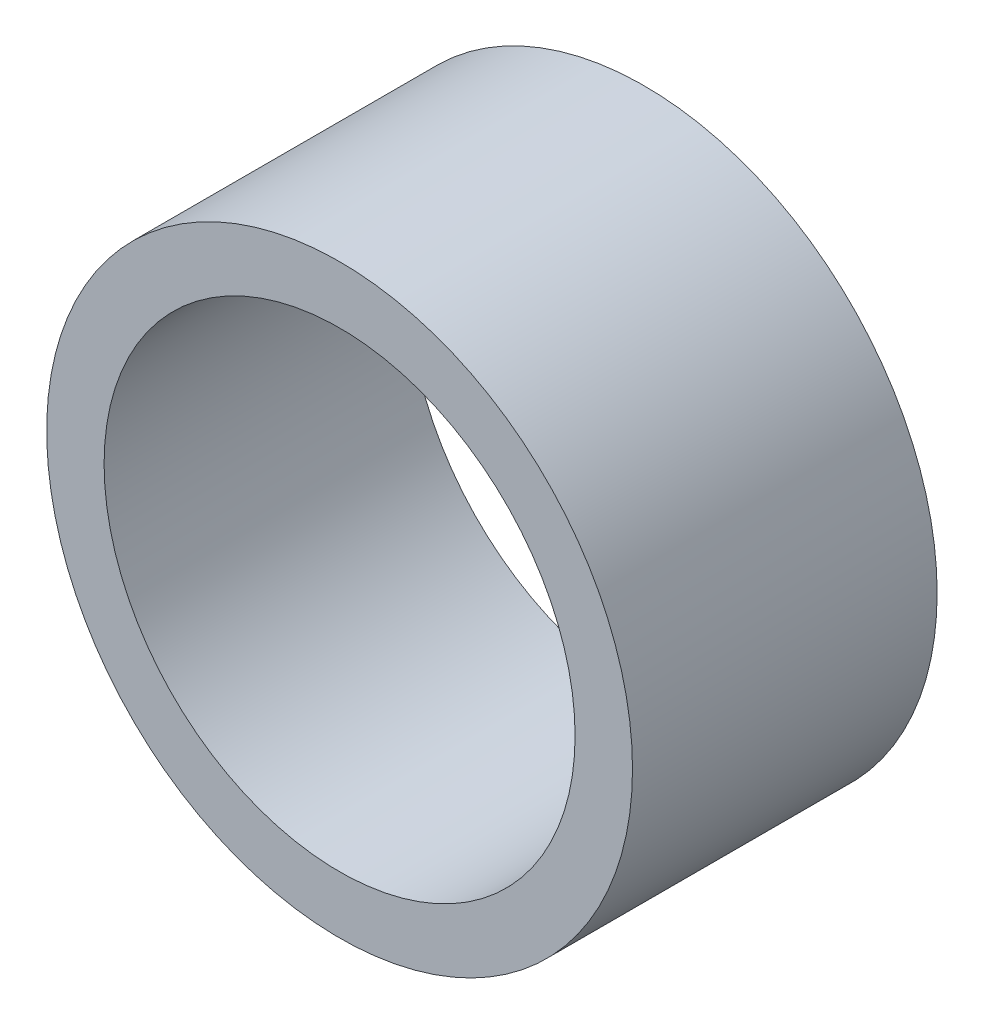
ISO-10303-21;
HEADER;
FILE_DESCRIPTION(('STEP AP214'),'2;1');
FILE_NAME('part.step','',(''),(''),'','','');
FILE_SCHEMA(('AUTOMOTIVE_DESIGN { 1 0 10303 214 1 1 1 1 }'));
ENDSEC;
DATA;
#1=APPLICATION_CONTEXT('core data for automotive mechanical design processes');
#2=APPLICATION_PROTOCOL_DEFINITION('international standard','automotive_design',2000,#1);
#3=PRODUCT_CONTEXT('',#1,'mechanical');
#4=PRODUCT('Part','Part','',(#3));
#5=PRODUCT_RELATED_PRODUCT_CATEGORY('part','',(#4));
#6=PRODUCT_DEFINITION_FORMATION('','',#4);
#7=PRODUCT_DEFINITION_CONTEXT('part definition',#1,'design');
#8=PRODUCT_DEFINITION('design','',#6,#7);
#9=PRODUCT_DEFINITION_SHAPE('','',#8);
#10=(LENGTH_UNIT() NAMED_UNIT(*) SI_UNIT(.MILLI.,.METRE.));
#11=(NAMED_UNIT(*) PLANE_ANGLE_UNIT() SI_UNIT($,.RADIAN.));
#12=(NAMED_UNIT(*) SI_UNIT($,.STERADIAN.) SOLID_ANGLE_UNIT());
#13=UNCERTAINTY_MEASURE_WITH_UNIT(LENGTH_MEASURE(1.E-05),#10,'distance_accuracy_value','');
#14=(GEOMETRIC_REPRESENTATION_CONTEXT(3) GLOBAL_UNCERTAINTY_ASSIGNED_CONTEXT((#13)) GLOBAL_UNIT_ASSIGNED_CONTEXT((#10,
#11,#12)) REPRESENTATION_CONTEXT('',''));
#15=CARTESIAN_POINT('',(0.,0.,0.));
#16=DIRECTION('',(0.,0.,1.));
#17=DIRECTION('',(1.,0.,0.));
#18=AXIS2_PLACEMENT_3D('',#15,#16,#17);
#19=CARTESIAN_POINT('',(0.,0.,3.302));
#20=DIRECTION('',(0.,0.,1.));
#21=DIRECTION('',(1.,0.,0.));
#22=AXIS2_PLACEMENT_3D('',#19,#20,#21);
#23=PLANE('',#22);
#24=CARTESIAN_POINT('',(0.,0.,3.302));
#25=DIRECTION('',(0.,0.,1.));
#26=DIRECTION('',(1.,0.,0.));
#27=AXIS2_PLACEMENT_3D('',#24,#25,#26);
#28=CIRCLE('',#27,6.35);
#29=CARTESIAN_POINT('',(6.35,0.,3.302));
#30=VERTEX_POINT('',#29);
#31=EDGE_CURVE('E10',#30,#30,#28,.T.);
#32=ORIENTED_EDGE('',*,*,#31,.T.);
#33=EDGE_LOOP('',(#32));
#34=FACE_BOUND('',#33,.T.);
#35=CARTESIAN_POINT('',(0.,0.,3.302));
#36=DIRECTION('',(0.,0.,1.));
#37=DIRECTION('',(1.,0.,0.));
#38=AXIS2_PLACEMENT_3D('',#35,#36,#37);
#39=CIRCLE('',#38,5.1054);
#40=CARTESIAN_POINT('',(5.1054,0.,3.302));
#41=VERTEX_POINT('',#40);
#42=EDGE_CURVE('E42',#41,#41,#39,.T.);
#43=ORIENTED_EDGE('',*,*,#42,.F.);
#44=EDGE_LOOP('',(#43));
#45=FACE_BOUND('',#44,.T.);
#46=ADVANCED_FACE('F35',(#34,#45),#23,.T.);
#47=CARTESIAN_POINT('',(0.,0.,3.302));
#48=DIRECTION('',(0.,0.,-1.));
#49=DIRECTION('',(-1.,0.,0.));
#50=AXIS2_PLACEMENT_3D('',#47,#48,#49);
#51=CYLINDRICAL_SURFACE('',#50,6.35);
#52=ORIENTED_EDGE('',*,*,#31,.F.);
#53=EDGE_LOOP('',(#52));
#54=FACE_BOUND('',#53,.T.);
#55=CARTESIAN_POINT('',(0.,0.,-3.302));
#56=DIRECTION('',(0.,0.,1.));
#57=DIRECTION('',(1.,0.,0.));
#58=AXIS2_PLACEMENT_3D('',#55,#56,#57);
#59=CIRCLE('',#58,6.35);
#60=CARTESIAN_POINT('',(6.35,0.,-3.302));
#61=VERTEX_POINT('',#60);
#62=EDGE_CURVE('E46',#61,#61,#59,.T.);
#63=ORIENTED_EDGE('',*,*,#62,.T.);
#64=EDGE_LOOP('',(#63));
#65=FACE_BOUND('',#64,.T.);
#66=ADVANCED_FACE('F37',(#54,#65),#51,.T.);
#67=CARTESIAN_POINT('',(0.,0.,3.302));
#68=DIRECTION('',(0.,0.,-1.));
#69=DIRECTION('',(-1.,0.,0.));
#70=AXIS2_PLACEMENT_3D('',#67,#68,#69);
#71=CYLINDRICAL_SURFACE('',#70,5.1054);
#72=ORIENTED_EDGE('',*,*,#42,.T.);
#73=EDGE_LOOP('',(#72));
#74=FACE_BOUND('',#73,.T.);
#75=CARTESIAN_POINT('',(0.,0.,-3.302));
#76=DIRECTION('',(0.,0.,1.));
#77=DIRECTION('',(1.,0.,0.));
#78=AXIS2_PLACEMENT_3D('',#75,#76,#77);
#79=CIRCLE('',#78,5.1054);
#80=CARTESIAN_POINT('',(5.1054,0.,-3.302));
#81=VERTEX_POINT('',#80);
#82=EDGE_CURVE('E50',#81,#81,#79,.T.);
#83=ORIENTED_EDGE('',*,*,#82,.F.);
#84=EDGE_LOOP('',(#83));
#85=FACE_BOUND('',#84,.T.);
#86=ADVANCED_FACE('F59',(#74,#85),#71,.F.);
#87=CARTESIAN_POINT('',(0.,0.,-3.302));
#88=DIRECTION('',(0.,0.,1.));
#89=DIRECTION('',(1.,0.,0.));
#90=AXIS2_PLACEMENT_3D('',#87,#88,#89);
#91=PLANE('',#90);
#92=ORIENTED_EDGE('',*,*,#82,.T.);
#93=EDGE_LOOP('',(#92));
#94=FACE_BOUND('',#93,.T.);
#95=ORIENTED_EDGE('',*,*,#62,.F.);
#96=EDGE_LOOP('',(#95));
#97=FACE_BOUND('',#96,.T.);
#98=ADVANCED_FACE('F56',(#94,#97),#91,.F.);
#99=CLOSED_SHELL('',(#46,#66,#86,#98));
#100=MANIFOLD_SOLID_BREP('B2',#99);
#101=ADVANCED_BREP_SHAPE_REPRESENTATION('',(#18,#100),#14);
#102=SHAPE_DEFINITION_REPRESENTATION(#9,#101);
ENDSEC;
END-ISO-10303-21;
